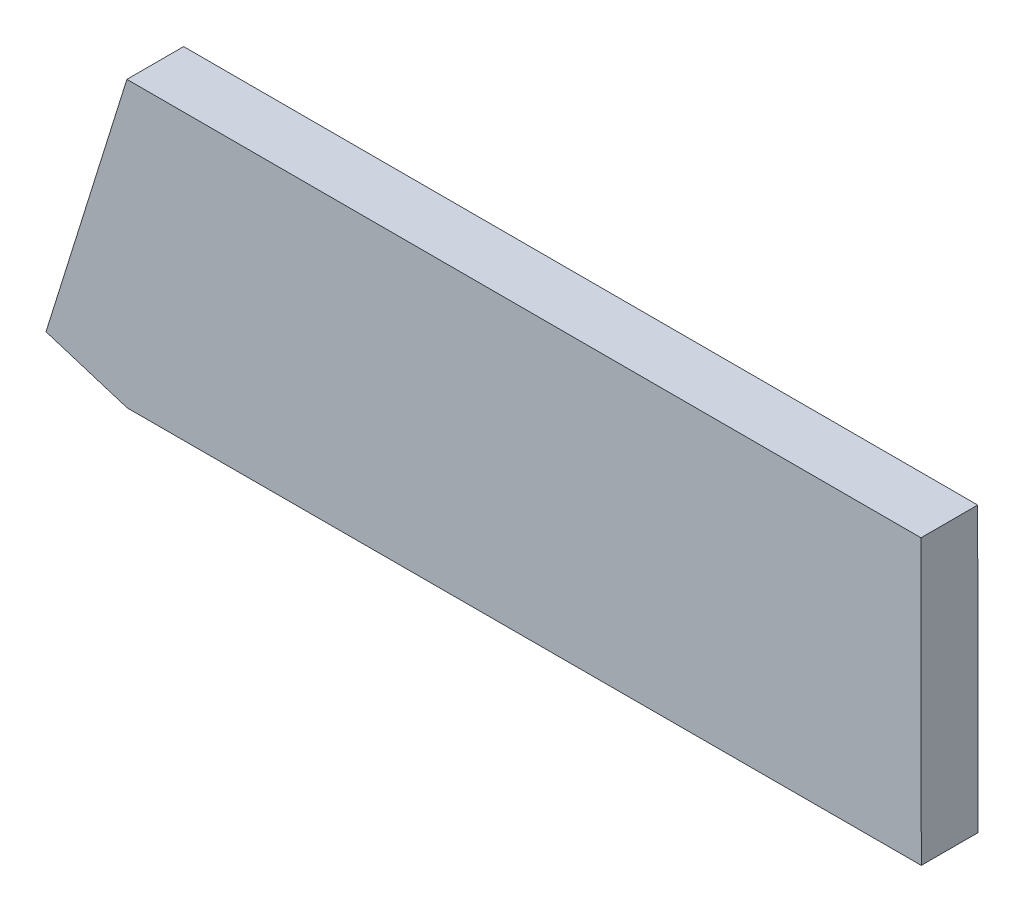
ISO-10303-21;
HEADER;
FILE_DESCRIPTION(('STEP AP214'),'2;1');
FILE_NAME('part.step','',(''),(''),'','','');
FILE_SCHEMA(('AUTOMOTIVE_DESIGN { 1 0 10303 214 1 1 1 1 }'));
ENDSEC;
DATA;
#1=APPLICATION_CONTEXT('core data for automotive mechanical design processes');
#2=APPLICATION_PROTOCOL_DEFINITION('international standard','automotive_design',2000,#1);
#3=PRODUCT_CONTEXT('',#1,'mechanical');
#4=PRODUCT('Part','Part','',(#3));
#5=PRODUCT_RELATED_PRODUCT_CATEGORY('part','',(#4));
#6=PRODUCT_DEFINITION_FORMATION('','',#4);
#7=PRODUCT_DEFINITION_CONTEXT('part definition',#1,'design');
#8=PRODUCT_DEFINITION('design','',#6,#7);
#9=PRODUCT_DEFINITION_SHAPE('','',#8);
#10=(LENGTH_UNIT() NAMED_UNIT(*) SI_UNIT(.MILLI.,.METRE.));
#11=(NAMED_UNIT(*) PLANE_ANGLE_UNIT() SI_UNIT($,.RADIAN.));
#12=(NAMED_UNIT(*) SI_UNIT($,.STERADIAN.) SOLID_ANGLE_UNIT());
#13=UNCERTAINTY_MEASURE_WITH_UNIT(LENGTH_MEASURE(1.E-05),#10,'distance_accuracy_value','');
#14=(GEOMETRIC_REPRESENTATION_CONTEXT(3) GLOBAL_UNCERTAINTY_ASSIGNED_CONTEXT((#13)) GLOBAL_UNIT_ASSIGNED_CONTEXT((#10,
#11,#12)) REPRESENTATION_CONTEXT('',''));
#15=CARTESIAN_POINT('',(0.,0.,0.));
#16=DIRECTION('',(0.,0.,1.));
#17=DIRECTION('',(1.,0.,0.));
#18=AXIS2_PLACEMENT_3D('',#15,#16,#17);
#19=CARTESIAN_POINT('',(-44.45,15.8984378604783,6.35));
#20=DIRECTION('',(0.954530740873662,-0.298112503473401,0.));
#21=DIRECTION('',(0.298112503473401,0.954530740873662,0.));
#22=AXIS2_PLACEMENT_3D('',#19,#20,#21);
#23=PLANE('',#22);
#24=DIRECTION('',(-0.298112503473401,-0.954530740873662,0.));
#25=VECTOR('',#24,1.);
#26=CARTESIAN_POINT('',(-44.45,15.8984378604783,0.));
#27=LINE('',#26,#25);
#28=CARTESIAN_POINT('',(-44.45,15.8984378604783,0.));
#29=VERTEX_POINT('',#28);
#30=CARTESIAN_POINT('',(-53.5083858721918,-13.1057390088565,0.));
#31=VERTEX_POINT('',#30);
#32=EDGE_CURVE('E122',#29,#31,#27,.T.);
#33=ORIENTED_EDGE('',*,*,#32,.T.);
#34=DIRECTION('',(0.,0.,-1.));
#35=VECTOR('',#34,1.);
#36=CARTESIAN_POINT('',(-53.5083858721918,-13.1057390088565,6.35));
#37=LINE('',#36,#35);
#38=CARTESIAN_POINT('',(-53.5083858721918,-13.1057390088565,6.35));
#39=VERTEX_POINT('',#38);
#40=EDGE_CURVE('E11',#39,#31,#37,.T.);
#41=ORIENTED_EDGE('',*,*,#40,.F.);
#42=DIRECTION('',(-0.298112503473401,-0.954530740873662,0.));
#43=VECTOR('',#42,1.);
#44=CARTESIAN_POINT('',(-44.45,15.8984378604783,6.35));
#45=LINE('',#44,#43);
#46=CARTESIAN_POINT('',(-44.45,15.8984378604783,6.35));
#47=VERTEX_POINT('',#46);
#48=EDGE_CURVE('E137',#47,#39,#45,.T.);
#49=ORIENTED_EDGE('',*,*,#48,.F.);
#50=DIRECTION('',(0.,0.,-1.));
#51=VECTOR('',#50,1.);
#52=CARTESIAN_POINT('',(-44.45,15.8984378604783,6.35));
#53=LINE('',#52,#51);
#54=EDGE_CURVE('E59',#47,#29,#53,.T.);
#55=ORIENTED_EDGE('',*,*,#54,.T.);
#56=EDGE_LOOP('',(#33,#41,#49,#55));
#57=FACE_BOUND('',#56,.T.);
#58=ADVANCED_FACE('F42',(#57),#23,.F.);
#59=CARTESIAN_POINT('',(-53.5083858721918,-13.1057390088565,6.35));
#60=DIRECTION('',(0.298112503473401,0.954530740873662,0.));
#61=DIRECTION('',(-0.954530740873662,0.298112503473401,0.));
#62=AXIS2_PLACEMENT_3D('',#59,#60,#61);
#63=PLANE('',#62);
#64=DIRECTION('',(0.954530740873662,-0.298112503473401,0.));
#65=VECTOR('',#64,1.);
#66=CARTESIAN_POINT('',(-53.5083858721918,-13.1057390088565,0.));
#67=LINE('',#66,#65);
#68=CARTESIAN_POINT('',(-44.4164805653702,-15.9452606044407,0.));
#69=VERTEX_POINT('',#68);
#70=EDGE_CURVE('E125',#31,#69,#67,.T.);
#71=ORIENTED_EDGE('',*,*,#70,.T.);
#72=DIRECTION('',(0.,0.,-1.));
#73=VECTOR('',#72,1.);
#74=CARTESIAN_POINT('',(-44.4164805653702,-15.9452606044407,6.35));
#75=LINE('',#74,#73);
#76=CARTESIAN_POINT('',(-44.4164805653702,-15.9452606044407,6.35));
#77=VERTEX_POINT('',#76);
#78=EDGE_CURVE('E51',#77,#69,#75,.T.);
#79=ORIENTED_EDGE('',*,*,#78,.F.);
#80=DIRECTION('',(0.954530740873662,-0.298112503473401,0.));
#81=VECTOR('',#80,1.);
#82=CARTESIAN_POINT('',(-53.5083858721918,-13.1057390088565,6.35));
#83=LINE('',#82,#81);
#84=EDGE_CURVE('E88',#39,#77,#83,.T.);
#85=ORIENTED_EDGE('',*,*,#84,.F.);
#86=ORIENTED_EDGE('',*,*,#40,.T.);
#87=EDGE_LOOP('',(#71,#79,#85,#86));
#88=FACE_BOUND('',#87,.T.);
#89=ADVANCED_FACE('F155',(#88),#63,.F.);
#90=CARTESIAN_POINT('',(-44.4164805653702,-15.9452606044407,6.35));
#91=DIRECTION('',(-0.00105417442691773,0.999999444357984,0.));
#92=DIRECTION('',(-0.999999444357985,-0.00105417442691773,0.));
#93=AXIS2_PLACEMENT_3D('',#90,#91,#92);
#94=PLANE('',#93);
#95=DIRECTION('',(0.999999444357984,0.00105417442691773,0.));
#96=VECTOR('',#95,1.);
#97=CARTESIAN_POINT('',(-44.4164805653702,-15.9452606044407,0.));
#98=LINE('',#97,#96);
#99=CARTESIAN_POINT('',(44.4834700380546,-15.8515444978877,0.));
#100=VERTEX_POINT('',#99);
#101=EDGE_CURVE('E109',#69,#100,#98,.T.);
#102=ORIENTED_EDGE('',*,*,#101,.T.);
#103=DIRECTION('',(0.,0.,-1.));
#104=VECTOR('',#103,1.);
#105=CARTESIAN_POINT('',(44.4834700380546,-15.8515444978877,6.35));
#106=LINE('',#105,#104);
#107=CARTESIAN_POINT('',(44.4834700380546,-15.8515444978877,6.35));
#108=VERTEX_POINT('',#107);
#109=EDGE_CURVE('E106',#108,#100,#106,.T.);
#110=ORIENTED_EDGE('',*,*,#109,.F.);
#111=DIRECTION('',(0.999999444357984,0.00105417442691773,0.));
#112=VECTOR('',#111,1.);
#113=CARTESIAN_POINT('',(-44.4164805653702,-15.9452606044407,6.35));
#114=LINE('',#113,#112);
#115=EDGE_CURVE('E95',#77,#108,#114,.T.);
#116=ORIENTED_EDGE('',*,*,#115,.F.);
#117=ORIENTED_EDGE('',*,*,#78,.T.);
#118=EDGE_LOOP('',(#102,#110,#116,#117));
#119=FACE_BOUND('',#118,.T.);
#120=ADVANCED_FACE('F107',(#119),#94,.F.);
#121=CARTESIAN_POINT('',(44.45,15.8984378604783,6.35));
#122=DIRECTION('',(0.999999444357984,0.00105417442691638,0.));
#123=DIRECTION('',(-0.00105417442691638,0.999999444357985,0.));
#124=AXIS2_PLACEMENT_3D('',#121,#122,#123);
#125=PLANE('',#124);
#126=DIRECTION('',(0.00105417442691638,-0.999999444357984,0.));
#127=VECTOR('',#126,1.);
#128=CARTESIAN_POINT('',(44.45,15.8984378604783,0.));
#129=LINE('',#128,#127);
#130=CARTESIAN_POINT('',(44.45,15.8984378604783,0.));
#131=VERTEX_POINT('',#130);
#132=EDGE_CURVE('E130',#131,#100,#129,.T.);
#133=ORIENTED_EDGE('',*,*,#132,.F.);
#134=DIRECTION('',(0.,0.,-1.));
#135=VECTOR('',#134,1.);
#136=CARTESIAN_POINT('',(44.45,15.8984378604783,6.35));
#137=LINE('',#136,#135);
#138=CARTESIAN_POINT('',(44.45,15.8984378604783,6.35));
#139=VERTEX_POINT('',#138);
#140=EDGE_CURVE('E76',#139,#131,#137,.T.);
#141=ORIENTED_EDGE('',*,*,#140,.F.);
#142=DIRECTION('',(0.00105417442691638,-0.999999444357984,0.));
#143=VECTOR('',#142,1.);
#144=CARTESIAN_POINT('',(44.45,15.8984378604783,6.35));
#145=LINE('',#144,#143);
#146=EDGE_CURVE('E100',#139,#108,#145,.T.);
#147=ORIENTED_EDGE('',*,*,#146,.T.);
#148=ORIENTED_EDGE('',*,*,#109,.T.);
#149=EDGE_LOOP('',(#133,#141,#147,#148));
#150=FACE_BOUND('',#149,.T.);
#151=ADVANCED_FACE('F114',(#150),#125,.T.);
#152=CARTESIAN_POINT('',(-44.45,15.8984378604783,6.35));
#153=DIRECTION('',(0.,1.,0.));
#154=DIRECTION('',(-1.,0.,0.));
#155=AXIS2_PLACEMENT_3D('',#152,#153,#154);
#156=PLANE('',#155);
#157=DIRECTION('',(1.,0.,0.));
#158=VECTOR('',#157,1.);
#159=CARTESIAN_POINT('',(-44.45,15.8984378604783,0.));
#160=LINE('',#159,#158);
#161=EDGE_CURVE('E133',#29,#131,#160,.T.);
#162=ORIENTED_EDGE('',*,*,#161,.F.);
#163=ORIENTED_EDGE('',*,*,#54,.F.);
#164=DIRECTION('',(1.,0.,0.));
#165=VECTOR('',#164,1.);
#166=CARTESIAN_POINT('',(-44.45,15.8984378604783,6.35));
#167=LINE('',#166,#165);
#168=EDGE_CURVE('E116',#47,#139,#167,.T.);
#169=ORIENTED_EDGE('',*,*,#168,.T.);
#170=ORIENTED_EDGE('',*,*,#140,.T.);
#171=EDGE_LOOP('',(#162,#163,#169,#170));
#172=FACE_BOUND('',#171,.T.);
#173=ADVANCED_FACE('F144',(#172),#156,.T.);
#174=CARTESIAN_POINT('',(0.,0.,6.35));
#175=DIRECTION('',(0.,0.,1.));
#176=DIRECTION('',(1.,0.,0.));
#177=AXIS2_PLACEMENT_3D('',#174,#175,#176);
#178=PLANE('',#177);
#179=ORIENTED_EDGE('',*,*,#48,.T.);
#180=ORIENTED_EDGE('',*,*,#84,.T.);
#181=ORIENTED_EDGE('',*,*,#115,.T.);
#182=ORIENTED_EDGE('',*,*,#146,.F.);
#183=ORIENTED_EDGE('',*,*,#168,.F.);
#184=EDGE_LOOP('',(#179,#180,#181,#182,#183));
#185=FACE_BOUND('',#184,.T.);
#186=ADVANCED_FACE('F97',(#185),#178,.T.);
#187=CARTESIAN_POINT('',(0.,0.,0.));
#188=DIRECTION('',(0.,0.,1.));
#189=DIRECTION('',(1.,0.,0.));
#190=AXIS2_PLACEMENT_3D('',#187,#188,#189);
#191=PLANE('',#190);
#192=ORIENTED_EDGE('',*,*,#32,.F.);
#193=ORIENTED_EDGE('',*,*,#161,.T.);
#194=ORIENTED_EDGE('',*,*,#132,.T.);
#195=ORIENTED_EDGE('',*,*,#101,.F.);
#196=ORIENTED_EDGE('',*,*,#70,.F.);
#197=EDGE_LOOP('',(#192,#193,#194,#195,#196));
#198=FACE_BOUND('',#197,.T.);
#199=ADVANCED_FACE('F143',(#198),#191,.F.);
#200=CLOSED_SHELL('',(#58,#89,#120,#151,#173,#186,#199));
#201=MANIFOLD_SOLID_BREP('B2',#200);
#202=ADVANCED_BREP_SHAPE_REPRESENTATION('',(#18,#201),#14);
#203=SHAPE_DEFINITION_REPRESENTATION(#9,#202);
ENDSEC;
END-ISO-10303-21;
